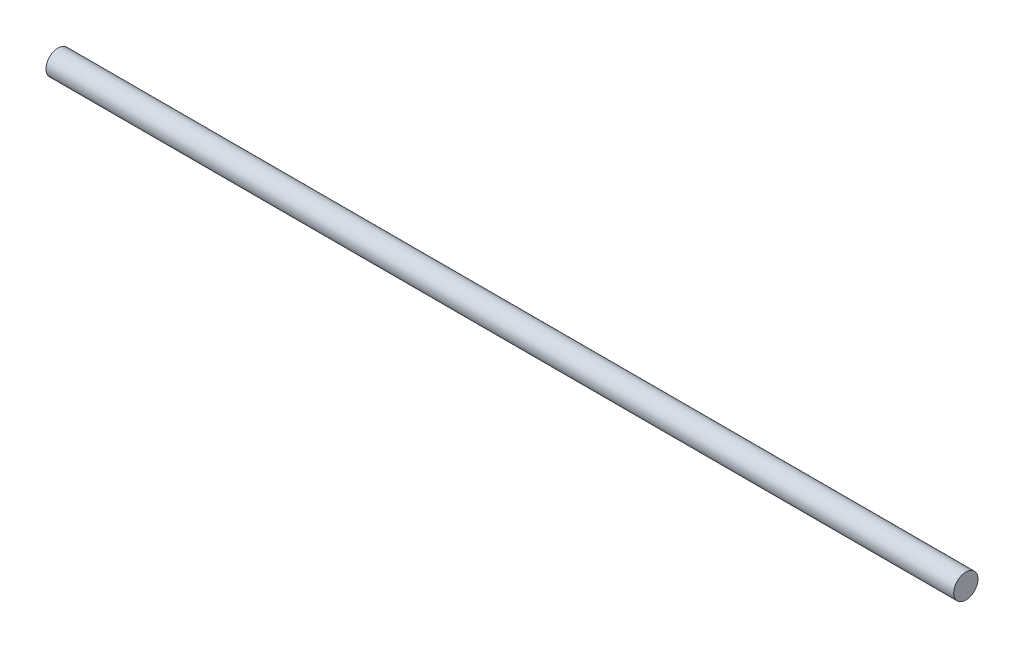
ISO-10303-21;
HEADER;
FILE_DESCRIPTION(('STEP AP214'),'2;1');
FILE_NAME('part.step','',(''),(''),'','','');
FILE_SCHEMA(('AUTOMOTIVE_DESIGN { 1 0 10303 214 1 1 1 1 }'));
ENDSEC;
DATA;
#1=APPLICATION_CONTEXT('core data for automotive mechanical design processes');
#2=APPLICATION_PROTOCOL_DEFINITION('international standard','automotive_design',2000,#1);
#3=PRODUCT_CONTEXT('',#1,'mechanical');
#4=PRODUCT('Part','Part','',(#3));
#5=PRODUCT_RELATED_PRODUCT_CATEGORY('part','',(#4));
#6=PRODUCT_DEFINITION_FORMATION('','',#4);
#7=PRODUCT_DEFINITION_CONTEXT('part definition',#1,'design');
#8=PRODUCT_DEFINITION('design','',#6,#7);
#9=PRODUCT_DEFINITION_SHAPE('','',#8);
#10=(LENGTH_UNIT() NAMED_UNIT(*) SI_UNIT(.MILLI.,.METRE.));
#11=(NAMED_UNIT(*) PLANE_ANGLE_UNIT() SI_UNIT($,.RADIAN.));
#12=(NAMED_UNIT(*) SI_UNIT($,.STERADIAN.) SOLID_ANGLE_UNIT());
#13=UNCERTAINTY_MEASURE_WITH_UNIT(LENGTH_MEASURE(1.E-05),#10,'distance_accuracy_value','');
#14=(GEOMETRIC_REPRESENTATION_CONTEXT(3) GLOBAL_UNCERTAINTY_ASSIGNED_CONTEXT((#13)) GLOBAL_UNIT_ASSIGNED_CONTEXT((#10,
#11,#12)) REPRESENTATION_CONTEXT('',''));
#15=CARTESIAN_POINT('',(0.,0.,0.));
#16=DIRECTION('',(0.,0.,1.));
#17=DIRECTION('',(1.,0.,0.));
#18=AXIS2_PLACEMENT_3D('',#15,#16,#17);
#19=CARTESIAN_POINT('',(355.6,0.,0.));
#20=DIRECTION('',(-1.,0.,0.));
#21=DIRECTION('',(0.,0.,1.));
#22=AXIS2_PLACEMENT_3D('',#19,#20,#21);
#23=CYLINDRICAL_SURFACE('',#22,4.7625);
#24=CARTESIAN_POINT('',(355.6,0.,0.));
#25=DIRECTION('',(1.,0.,0.));
#26=DIRECTION('',(0.,0.,-1.));
#27=AXIS2_PLACEMENT_3D('',#24,#25,#26);
#28=CIRCLE('',#27,4.7625);
#29=CARTESIAN_POINT('',(355.6,0.,-4.7625));
#30=VERTEX_POINT('',#29);
#31=EDGE_CURVE('E10',#30,#30,#28,.T.);
#32=ORIENTED_EDGE('',*,*,#31,.F.);
#33=EDGE_LOOP('',(#32));
#34=FACE_BOUND('',#33,.T.);
#35=CARTESIAN_POINT('',(0.,0.,0.));
#36=DIRECTION('',(1.,0.,0.));
#37=DIRECTION('',(0.,0.,-1.));
#38=AXIS2_PLACEMENT_3D('',#35,#36,#37);
#39=CIRCLE('',#38,4.7625);
#40=CARTESIAN_POINT('',(0.,0.,-4.7625));
#41=VERTEX_POINT('',#40);
#42=EDGE_CURVE('E34',#41,#41,#39,.T.);
#43=ORIENTED_EDGE('',*,*,#42,.T.);
#44=EDGE_LOOP('',(#43));
#45=FACE_BOUND('',#44,.T.);
#46=ADVANCED_FACE('F31',(#34,#45),#23,.T.);
#47=CARTESIAN_POINT('',(355.6,0.,0.));
#48=DIRECTION('',(1.,0.,0.));
#49=DIRECTION('',(0.,0.,-1.));
#50=AXIS2_PLACEMENT_3D('',#47,#48,#49);
#51=PLANE('',#50);
#52=ORIENTED_EDGE('',*,*,#31,.T.);
#53=EDGE_LOOP('',(#52));
#54=FACE_BOUND('',#53,.T.);
#55=ADVANCED_FACE('F46',(#54),#51,.T.);
#56=CARTESIAN_POINT('',(0.,0.,0.));
#57=DIRECTION('',(1.,0.,0.));
#58=DIRECTION('',(0.,0.,-1.));
#59=AXIS2_PLACEMENT_3D('',#56,#57,#58);
#60=PLANE('',#59);
#61=ORIENTED_EDGE('',*,*,#42,.F.);
#62=EDGE_LOOP('',(#61));
#63=FACE_BOUND('',#62,.T.);
#64=ADVANCED_FACE('F44',(#63),#60,.F.);
#65=CLOSED_SHELL('',(#46,#55,#64));
#66=MANIFOLD_SOLID_BREP('B2',#65);
#67=ADVANCED_BREP_SHAPE_REPRESENTATION('',(#18,#66),#14);
#68=SHAPE_DEFINITION_REPRESENTATION(#9,#67);
ENDSEC;
END-ISO-10303-21;
